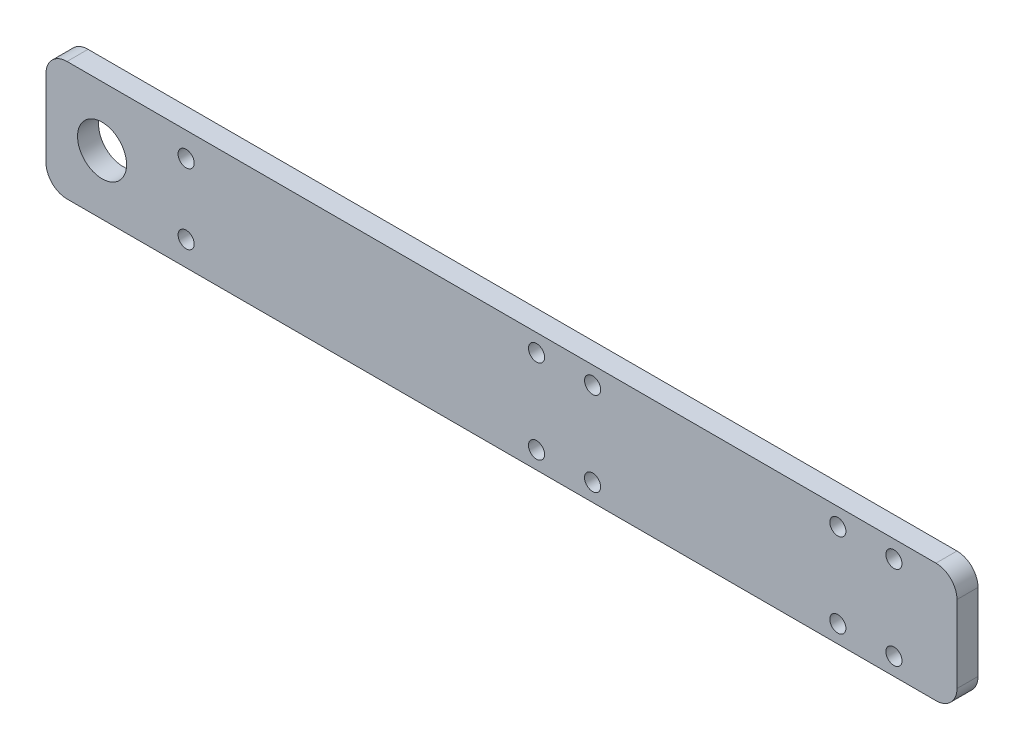
ISO-10303-21;
HEADER;
FILE_DESCRIPTION(('STEP AP214'),'2;1');
FILE_NAME('part.step','',(''),(''),'','','');
FILE_SCHEMA(('AUTOMOTIVE_DESIGN { 1 0 10303 214 1 1 1 1 }'));
ENDSEC;
DATA;
#1=APPLICATION_CONTEXT('core data for automotive mechanical design processes');
#2=APPLICATION_PROTOCOL_DEFINITION('international standard','automotive_design',2000,#1);
#3=PRODUCT_CONTEXT('',#1,'mechanical');
#4=PRODUCT('Part','Part','',(#3));
#5=PRODUCT_RELATED_PRODUCT_CATEGORY('part','',(#4));
#6=PRODUCT_DEFINITION_FORMATION('','',#4);
#7=PRODUCT_DEFINITION_CONTEXT('part definition',#1,'design');
#8=PRODUCT_DEFINITION('design','',#6,#7);
#9=PRODUCT_DEFINITION_SHAPE('','',#8);
#10=(LENGTH_UNIT() NAMED_UNIT(*) SI_UNIT(.MILLI.,.METRE.));
#11=(NAMED_UNIT(*) PLANE_ANGLE_UNIT() SI_UNIT($,.RADIAN.));
#12=(NAMED_UNIT(*) SI_UNIT($,.STERADIAN.) SOLID_ANGLE_UNIT());
#13=UNCERTAINTY_MEASURE_WITH_UNIT(LENGTH_MEASURE(1.E-05),#10,'distance_accuracy_value','');
#14=(GEOMETRIC_REPRESENTATION_CONTEXT(3) GLOBAL_UNCERTAINTY_ASSIGNED_CONTEXT((#13)) GLOBAL_UNIT_ASSIGNED_CONTEXT((#10,
#11,#12)) REPRESENTATION_CONTEXT('',''));
#15=CARTESIAN_POINT('',(0.,0.,0.));
#16=DIRECTION('',(0.,0.,1.));
#17=DIRECTION('',(1.,0.,0.));
#18=AXIS2_PLACEMENT_3D('',#15,#16,#17);
#19=CARTESIAN_POINT('',(0.,0.,3.));
#20=DIRECTION('',(0.,0.,-1.));
#21=DIRECTION('',(-1.,0.,0.));
#22=AXIS2_PLACEMENT_3D('',#19,#20,#21);
#23=PLANE('',#22);
#24=DIRECTION('',(1.,0.,0.));
#25=VECTOR('',#24,1.);
#26=CARTESIAN_POINT('',(-65.,-8.5,3.));
#27=LINE('',#26,#25);
#28=CARTESIAN_POINT('',(-62.,-8.5,3.));
#29=VERTEX_POINT('',#28);
#30=CARTESIAN_POINT('',(62.,-8.5,3.));
#31=VERTEX_POINT('',#30);
#32=EDGE_CURVE('E136',#29,#31,#27,.T.);
#33=ORIENTED_EDGE('',*,*,#32,.T.);
#34=CARTESIAN_POINT('',(62.,-5.5,3.));
#35=DIRECTION('',(0.,0.,-1.));
#36=DIRECTION('',(-1.,0.,0.));
#37=AXIS2_PLACEMENT_3D('',#34,#35,#36);
#38=CIRCLE('',#37,3.);
#39=CARTESIAN_POINT('',(65.,-5.5,3.));
#40=VERTEX_POINT('',#39);
#41=EDGE_CURVE('E155',#31,#40,#38,.F.);
#42=ORIENTED_EDGE('',*,*,#41,.T.);
#43=DIRECTION('',(0.,1.,0.));
#44=VECTOR('',#43,1.);
#45=CARTESIAN_POINT('',(65.,-8.5,3.));
#46=LINE('',#45,#44);
#47=CARTESIAN_POINT('',(65.,5.5,3.));
#48=VERTEX_POINT('',#47);
#49=EDGE_CURVE('E119',#40,#48,#46,.T.);
#50=ORIENTED_EDGE('',*,*,#49,.T.);
#51=CARTESIAN_POINT('',(62.,5.5,3.));
#52=DIRECTION('',(0.,0.,-1.));
#53=DIRECTION('',(-1.,0.,0.));
#54=AXIS2_PLACEMENT_3D('',#51,#52,#53);
#55=CIRCLE('',#54,3.);
#56=CARTESIAN_POINT('',(62.,8.5,3.));
#57=VERTEX_POINT('',#56);
#58=EDGE_CURVE('E153',#48,#57,#55,.F.);
#59=ORIENTED_EDGE('',*,*,#58,.T.);
#60=DIRECTION('',(-1.,0.,0.));
#61=VECTOR('',#60,1.);
#62=CARTESIAN_POINT('',(-65.,8.5,3.));
#63=LINE('',#62,#61);
#64=CARTESIAN_POINT('',(-62.,8.5,3.));
#65=VERTEX_POINT('',#64);
#66=EDGE_CURVE('E175',#57,#65,#63,.T.);
#67=ORIENTED_EDGE('',*,*,#66,.T.);
#68=CARTESIAN_POINT('',(-62.,5.5,3.));
#69=DIRECTION('',(0.,0.,-1.));
#70=DIRECTION('',(-1.,0.,0.));
#71=AXIS2_PLACEMENT_3D('',#68,#69,#70);
#72=CIRCLE('',#71,3.);
#73=CARTESIAN_POINT('',(-65.,5.5,3.));
#74=VERTEX_POINT('',#73);
#75=EDGE_CURVE('E54',#65,#74,#72,.F.);
#76=ORIENTED_EDGE('',*,*,#75,.T.);
#77=DIRECTION('',(0.,-1.,0.));
#78=VECTOR('',#77,1.);
#79=CARTESIAN_POINT('',(-65.,-8.5,3.));
#80=LINE('',#79,#78);
#81=CARTESIAN_POINT('',(-65.,-5.5,3.));
#82=VERTEX_POINT('',#81);
#83=EDGE_CURVE('E165',#74,#82,#80,.T.);
#84=ORIENTED_EDGE('',*,*,#83,.T.);
#85=CARTESIAN_POINT('',(-62.,-5.5,3.));
#86=DIRECTION('',(0.,0.,-1.));
#87=DIRECTION('',(-1.,0.,0.));
#88=AXIS2_PLACEMENT_3D('',#85,#86,#87);
#89=CIRCLE('',#88,3.);
#90=EDGE_CURVE('E151',#82,#29,#89,.F.);
#91=ORIENTED_EDGE('',*,*,#90,.T.);
#92=EDGE_LOOP('',(#33,#42,#50,#59,#67,#76,#84,#91));
#93=FACE_BOUND('',#92,.T.);
#94=CARTESIAN_POINT('',(-57.,0.,3.));
#95=DIRECTION('',(0.,0.,1.));
#96=DIRECTION('',(1.,0.,0.));
#97=AXIS2_PLACEMENT_3D('',#94,#95,#96);
#98=CIRCLE('',#97,3.5);
#99=CARTESIAN_POINT('',(-53.5,0.,3.));
#100=VERTEX_POINT('',#99);
#101=EDGE_CURVE('E127',#100,#100,#98,.T.);
#102=ORIENTED_EDGE('',*,*,#101,.F.);
#103=EDGE_LOOP('',(#102));
#104=FACE_BOUND('',#103,.T.);
#105=CARTESIAN_POINT('',(-45.,4.99999999999998,3.));
#106=DIRECTION('',(0.,0.,1.));
#107=DIRECTION('',(1.,0.,0.));
#108=AXIS2_PLACEMENT_3D('',#105,#106,#107);
#109=CIRCLE('',#108,1.15);
#110=CARTESIAN_POINT('',(-43.85,4.99999999999998,3.));
#111=VERTEX_POINT('',#110);
#112=EDGE_CURVE('E180',#111,#111,#109,.T.);
#113=ORIENTED_EDGE('',*,*,#112,.F.);
#114=EDGE_LOOP('',(#113));
#115=FACE_BOUND('',#114,.T.);
#116=CARTESIAN_POINT('',(-45.,-5.00000000000002,3.));
#117=DIRECTION('',(0.,0.,1.));
#118=DIRECTION('',(-1.,0.,0.));
#119=AXIS2_PLACEMENT_3D('',#116,#117,#118);
#120=CIRCLE('',#119,1.15);
#121=CARTESIAN_POINT('',(-46.15,-5.00000000000002,3.));
#122=VERTEX_POINT('',#121);
#123=EDGE_CURVE('E185',#122,#122,#120,.T.);
#124=ORIENTED_EDGE('',*,*,#123,.F.);
#125=EDGE_LOOP('',(#124));
#126=FACE_BOUND('',#125,.T.);
#127=CARTESIAN_POINT('',(5.00000000000002,5.99999999999999,3.));
#128=DIRECTION('',(0.,0.,1.));
#129=DIRECTION('',(1.,0.,0.));
#130=AXIS2_PLACEMENT_3D('',#127,#128,#129);
#131=CIRCLE('',#130,1.15);
#132=CARTESIAN_POINT('',(6.15000000000002,5.99999999999999,3.));
#133=VERTEX_POINT('',#132);
#134=EDGE_CURVE('E191',#133,#133,#131,.T.);
#135=ORIENTED_EDGE('',*,*,#134,.F.);
#136=EDGE_LOOP('',(#135));
#137=FACE_BOUND('',#136,.T.);
#138=CARTESIAN_POINT('',(13.,5.99999999999999,3.));
#139=DIRECTION('',(0.,0.,1.));
#140=DIRECTION('',(1.,0.,0.));
#141=AXIS2_PLACEMENT_3D('',#138,#139,#140);
#142=CIRCLE('',#141,1.15000000000001);
#143=CARTESIAN_POINT('',(14.15,5.99999999999999,3.));
#144=VERTEX_POINT('',#143);
#145=EDGE_CURVE('E197',#144,#144,#142,.T.);
#146=ORIENTED_EDGE('',*,*,#145,.F.);
#147=EDGE_LOOP('',(#146));
#148=FACE_BOUND('',#147,.T.);
#149=CARTESIAN_POINT('',(5.00000000000002,-6.00000000000001,3.));
#150=DIRECTION('',(0.,0.,1.));
#151=DIRECTION('',(-1.,0.,0.));
#152=AXIS2_PLACEMENT_3D('',#149,#150,#151);
#153=CIRCLE('',#152,1.15);
#154=CARTESIAN_POINT('',(3.85000000000002,-6.00000000000001,3.));
#155=VERTEX_POINT('',#154);
#156=EDGE_CURVE('E203',#155,#155,#153,.T.);
#157=ORIENTED_EDGE('',*,*,#156,.F.);
#158=EDGE_LOOP('',(#157));
#159=FACE_BOUND('',#158,.T.);
#160=CARTESIAN_POINT('',(13.,-6.00000000000001,3.));
#161=DIRECTION('',(0.,0.,1.));
#162=DIRECTION('',(-1.,0.,0.));
#163=AXIS2_PLACEMENT_3D('',#160,#161,#162);
#164=CIRCLE('',#163,1.15);
#165=CARTESIAN_POINT('',(11.85,-6.00000000000001,3.));
#166=VERTEX_POINT('',#165);
#167=EDGE_CURVE('E209',#166,#166,#164,.T.);
#168=ORIENTED_EDGE('',*,*,#167,.F.);
#169=EDGE_LOOP('',(#168));
#170=FACE_BOUND('',#169,.T.);
#171=CARTESIAN_POINT('',(56.,5.99999999999999,3.));
#172=DIRECTION('',(0.,0.,1.));
#173=DIRECTION('',(1.,0.,0.));
#174=AXIS2_PLACEMENT_3D('',#171,#172,#173);
#175=CIRCLE('',#174,1.15);
#176=CARTESIAN_POINT('',(57.15,5.99999999999999,3.));
#177=VERTEX_POINT('',#176);
#178=EDGE_CURVE('E215',#177,#177,#175,.T.);
#179=ORIENTED_EDGE('',*,*,#178,.F.);
#180=EDGE_LOOP('',(#179));
#181=FACE_BOUND('',#180,.T.);
#182=CARTESIAN_POINT('',(48.,5.99999999999999,3.));
#183=DIRECTION('',(0.,0.,1.));
#184=DIRECTION('',(1.,0.,0.));
#185=AXIS2_PLACEMENT_3D('',#182,#183,#184);
#186=CIRCLE('',#185,1.15);
#187=CARTESIAN_POINT('',(49.15,5.99999999999999,3.));
#188=VERTEX_POINT('',#187);
#189=EDGE_CURVE('E221',#188,#188,#186,.T.);
#190=ORIENTED_EDGE('',*,*,#189,.F.);
#191=EDGE_LOOP('',(#190));
#192=FACE_BOUND('',#191,.T.);
#193=CARTESIAN_POINT('',(56.,-6.,3.));
#194=DIRECTION('',(0.,0.,1.));
#195=DIRECTION('',(-1.,0.,0.));
#196=AXIS2_PLACEMENT_3D('',#193,#194,#195);
#197=CIRCLE('',#196,1.15);
#198=CARTESIAN_POINT('',(54.85,-6.,3.));
#199=VERTEX_POINT('',#198);
#200=EDGE_CURVE('E227',#199,#199,#197,.T.);
#201=ORIENTED_EDGE('',*,*,#200,.F.);
#202=EDGE_LOOP('',(#201));
#203=FACE_BOUND('',#202,.T.);
#204=CARTESIAN_POINT('',(48.,-6.,3.));
#205=DIRECTION('',(0.,0.,1.));
#206=DIRECTION('',(-1.,0.,0.));
#207=AXIS2_PLACEMENT_3D('',#204,#205,#206);
#208=CIRCLE('',#207,1.15);
#209=CARTESIAN_POINT('',(46.85,-6.,3.));
#210=VERTEX_POINT('',#209);
#211=EDGE_CURVE('E233',#210,#210,#208,.T.);
#212=ORIENTED_EDGE('',*,*,#211,.F.);
#213=EDGE_LOOP('',(#212));
#214=FACE_BOUND('',#213,.T.);
#215=ADVANCED_FACE('F34',(#93,#104,#115,#126,#137,#148,#159,#170,#181,#192,#203,#214),#23,.F.);
#216=CARTESIAN_POINT('',(0.,0.,0.));
#217=DIRECTION('',(0.,0.,-1.));
#218=DIRECTION('',(-1.,0.,0.));
#219=AXIS2_PLACEMENT_3D('',#216,#217,#218);
#220=PLANE('',#219);
#221=CARTESIAN_POINT('',(56.,-6.,0.));
#222=DIRECTION('',(0.,0.,1.));
#223=DIRECTION('',(-1.,0.,0.));
#224=AXIS2_PLACEMENT_3D('',#221,#222,#223);
#225=CIRCLE('',#224,1.15);
#226=CARTESIAN_POINT('',(54.85,-6.,0.));
#227=VERTEX_POINT('',#226);
#228=EDGE_CURVE('E230',#227,#227,#225,.T.);
#229=ORIENTED_EDGE('',*,*,#228,.T.);
#230=EDGE_LOOP('',(#229));
#231=FACE_BOUND('',#230,.T.);
#232=CARTESIAN_POINT('',(56.,5.99999999999999,0.));
#233=DIRECTION('',(0.,0.,1.));
#234=DIRECTION('',(1.,0.,0.));
#235=AXIS2_PLACEMENT_3D('',#232,#233,#234);
#236=CIRCLE('',#235,1.15);
#237=CARTESIAN_POINT('',(57.15,5.99999999999999,0.));
#238=VERTEX_POINT('',#237);
#239=EDGE_CURVE('E218',#238,#238,#236,.T.);
#240=ORIENTED_EDGE('',*,*,#239,.T.);
#241=EDGE_LOOP('',(#240));
#242=FACE_BOUND('',#241,.T.);
#243=CARTESIAN_POINT('',(5.00000000000002,-6.00000000000001,0.));
#244=DIRECTION('',(0.,0.,1.));
#245=DIRECTION('',(-1.,0.,0.));
#246=AXIS2_PLACEMENT_3D('',#243,#244,#245);
#247=CIRCLE('',#246,1.15);
#248=CARTESIAN_POINT('',(3.85000000000002,-6.00000000000001,0.));
#249=VERTEX_POINT('',#248);
#250=EDGE_CURVE('E206',#249,#249,#247,.T.);
#251=ORIENTED_EDGE('',*,*,#250,.T.);
#252=EDGE_LOOP('',(#251));
#253=FACE_BOUND('',#252,.T.);
#254=CARTESIAN_POINT('',(5.00000000000002,5.99999999999999,0.));
#255=DIRECTION('',(0.,0.,1.));
#256=DIRECTION('',(1.,0.,0.));
#257=AXIS2_PLACEMENT_3D('',#254,#255,#256);
#258=CIRCLE('',#257,1.15);
#259=CARTESIAN_POINT('',(6.15000000000002,5.99999999999999,0.));
#260=VERTEX_POINT('',#259);
#261=EDGE_CURVE('E194',#260,#260,#258,.T.);
#262=ORIENTED_EDGE('',*,*,#261,.T.);
#263=EDGE_LOOP('',(#262));
#264=FACE_BOUND('',#263,.T.);
#265=CARTESIAN_POINT('',(-45.,4.99999999999998,0.));
#266=DIRECTION('',(0.,0.,1.));
#267=DIRECTION('',(1.,0.,0.));
#268=AXIS2_PLACEMENT_3D('',#265,#266,#267);
#269=CIRCLE('',#268,1.15);
#270=CARTESIAN_POINT('',(-43.85,4.99999999999998,0.));
#271=VERTEX_POINT('',#270);
#272=EDGE_CURVE('E182',#271,#271,#269,.T.);
#273=ORIENTED_EDGE('',*,*,#272,.T.);
#274=EDGE_LOOP('',(#273));
#275=FACE_BOUND('',#274,.T.);
#276=DIRECTION('',(0.,1.,0.));
#277=VECTOR('',#276,1.);
#278=CARTESIAN_POINT('',(65.,-8.5,0.));
#279=LINE('',#278,#277);
#280=CARTESIAN_POINT('',(65.,-5.5,0.));
#281=VERTEX_POINT('',#280);
#282=CARTESIAN_POINT('',(65.,5.5,0.));
#283=VERTEX_POINT('',#282);
#284=EDGE_CURVE('E116',#281,#283,#279,.T.);
#285=ORIENTED_EDGE('',*,*,#284,.F.);
#286=CARTESIAN_POINT('',(62.,-5.5,0.));
#287=DIRECTION('',(0.,0.,-1.));
#288=DIRECTION('',(-1.,0.,0.));
#289=AXIS2_PLACEMENT_3D('',#286,#287,#288);
#290=CIRCLE('',#289,3.);
#291=CARTESIAN_POINT('',(62.,-8.5,0.));
#292=VERTEX_POINT('',#291);
#293=EDGE_CURVE('E99',#281,#292,#290,.T.);
#294=ORIENTED_EDGE('',*,*,#293,.T.);
#295=DIRECTION('',(1.,0.,0.));
#296=VECTOR('',#295,1.);
#297=CARTESIAN_POINT('',(-65.,-8.5,0.));
#298=LINE('',#297,#296);
#299=CARTESIAN_POINT('',(-62.,-8.5,0.));
#300=VERTEX_POINT('',#299);
#301=EDGE_CURVE('E140',#300,#292,#298,.T.);
#302=ORIENTED_EDGE('',*,*,#301,.F.);
#303=CARTESIAN_POINT('',(-62.,-5.5,0.));
#304=DIRECTION('',(0.,0.,-1.));
#305=DIRECTION('',(-1.,0.,0.));
#306=AXIS2_PLACEMENT_3D('',#303,#304,#305);
#307=CIRCLE('',#306,3.);
#308=CARTESIAN_POINT('',(-65.,-5.5,0.));
#309=VERTEX_POINT('',#308);
#310=EDGE_CURVE('E144',#300,#309,#307,.T.);
#311=ORIENTED_EDGE('',*,*,#310,.T.);
#312=DIRECTION('',(0.,-1.,0.));
#313=VECTOR('',#312,1.);
#314=CARTESIAN_POINT('',(-65.,-8.5,0.));
#315=LINE('',#314,#313);
#316=CARTESIAN_POINT('',(-65.,5.5,0.));
#317=VERTEX_POINT('',#316);
#318=EDGE_CURVE('E130',#317,#309,#315,.T.);
#319=ORIENTED_EDGE('',*,*,#318,.F.);
#320=CARTESIAN_POINT('',(-62.,5.5,0.));
#321=DIRECTION('',(0.,0.,-1.));
#322=DIRECTION('',(-1.,0.,0.));
#323=AXIS2_PLACEMENT_3D('',#320,#321,#322);
#324=CIRCLE('',#323,3.);
#325=CARTESIAN_POINT('',(-62.,8.5,0.));
#326=VERTEX_POINT('',#325);
#327=EDGE_CURVE('E120',#317,#326,#324,.T.);
#328=ORIENTED_EDGE('',*,*,#327,.T.);
#329=DIRECTION('',(-1.,0.,0.));
#330=VECTOR('',#329,1.);
#331=CARTESIAN_POINT('',(-65.,8.5,0.));
#332=LINE('',#331,#330);
#333=CARTESIAN_POINT('',(62.,8.5,0.));
#334=VERTEX_POINT('',#333);
#335=EDGE_CURVE('E126',#334,#326,#332,.T.);
#336=ORIENTED_EDGE('',*,*,#335,.F.);
#337=CARTESIAN_POINT('',(62.,5.5,0.));
#338=DIRECTION('',(0.,0.,-1.));
#339=DIRECTION('',(-1.,0.,0.));
#340=AXIS2_PLACEMENT_3D('',#337,#338,#339);
#341=CIRCLE('',#340,3.);
#342=EDGE_CURVE('E110',#334,#283,#341,.T.);
#343=ORIENTED_EDGE('',*,*,#342,.T.);
#344=EDGE_LOOP('',(#285,#294,#302,#311,#319,#328,#336,#343));
#345=FACE_BOUND('',#344,.T.);
#346=CARTESIAN_POINT('',(-57.,0.,0.));
#347=DIRECTION('',(0.,0.,1.));
#348=DIRECTION('',(1.,0.,0.));
#349=AXIS2_PLACEMENT_3D('',#346,#347,#348);
#350=CIRCLE('',#349,3.5);
#351=CARTESIAN_POINT('',(-53.5,0.,0.));
#352=VERTEX_POINT('',#351);
#353=EDGE_CURVE('E133',#352,#352,#350,.T.);
#354=ORIENTED_EDGE('',*,*,#353,.T.);
#355=EDGE_LOOP('',(#354));
#356=FACE_BOUND('',#355,.T.);
#357=CARTESIAN_POINT('',(-45.,-5.00000000000002,0.));
#358=DIRECTION('',(0.,0.,1.));
#359=DIRECTION('',(-1.,0.,0.));
#360=AXIS2_PLACEMENT_3D('',#357,#358,#359);
#361=CIRCLE('',#360,1.15);
#362=CARTESIAN_POINT('',(-46.15,-5.00000000000002,0.));
#363=VERTEX_POINT('',#362);
#364=EDGE_CURVE('E188',#363,#363,#361,.T.);
#365=ORIENTED_EDGE('',*,*,#364,.T.);
#366=EDGE_LOOP('',(#365));
#367=FACE_BOUND('',#366,.T.);
#368=CARTESIAN_POINT('',(13.,5.99999999999999,0.));
#369=DIRECTION('',(0.,0.,1.));
#370=DIRECTION('',(1.,0.,0.));
#371=AXIS2_PLACEMENT_3D('',#368,#369,#370);
#372=CIRCLE('',#371,1.15000000000001);
#373=CARTESIAN_POINT('',(14.15,5.99999999999999,0.));
#374=VERTEX_POINT('',#373);
#375=EDGE_CURVE('E200',#374,#374,#372,.T.);
#376=ORIENTED_EDGE('',*,*,#375,.T.);
#377=EDGE_LOOP('',(#376));
#378=FACE_BOUND('',#377,.T.);
#379=CARTESIAN_POINT('',(13.,-6.00000000000001,0.));
#380=DIRECTION('',(0.,0.,1.));
#381=DIRECTION('',(-1.,0.,0.));
#382=AXIS2_PLACEMENT_3D('',#379,#380,#381);
#383=CIRCLE('',#382,1.15);
#384=CARTESIAN_POINT('',(11.85,-6.00000000000001,0.));
#385=VERTEX_POINT('',#384);
#386=EDGE_CURVE('E212',#385,#385,#383,.T.);
#387=ORIENTED_EDGE('',*,*,#386,.T.);
#388=EDGE_LOOP('',(#387));
#389=FACE_BOUND('',#388,.T.);
#390=CARTESIAN_POINT('',(48.,5.99999999999999,0.));
#391=DIRECTION('',(0.,0.,1.));
#392=DIRECTION('',(1.,0.,0.));
#393=AXIS2_PLACEMENT_3D('',#390,#391,#392);
#394=CIRCLE('',#393,1.15);
#395=CARTESIAN_POINT('',(49.15,5.99999999999999,0.));
#396=VERTEX_POINT('',#395);
#397=EDGE_CURVE('E224',#396,#396,#394,.T.);
#398=ORIENTED_EDGE('',*,*,#397,.T.);
#399=EDGE_LOOP('',(#398));
#400=FACE_BOUND('',#399,.T.);
#401=CARTESIAN_POINT('',(48.,-6.,0.));
#402=DIRECTION('',(0.,0.,1.));
#403=DIRECTION('',(-1.,0.,0.));
#404=AXIS2_PLACEMENT_3D('',#401,#402,#403);
#405=CIRCLE('',#404,1.15);
#406=CARTESIAN_POINT('',(46.85,-6.,0.));
#407=VERTEX_POINT('',#406);
#408=EDGE_CURVE('E236',#407,#407,#405,.T.);
#409=ORIENTED_EDGE('',*,*,#408,.T.);
#410=EDGE_LOOP('',(#409));
#411=FACE_BOUND('',#410,.T.);
#412=ADVANCED_FACE('F123',(#231,#242,#253,#264,#275,#345,#356,#367,#378,#389,#400,#411),#220,.T.);
#413=CARTESIAN_POINT('',(65.,-8.5,3.));
#414=DIRECTION('',(-1.,0.,0.));
#415=DIRECTION('',(0.,0.,1.));
#416=AXIS2_PLACEMENT_3D('',#413,#414,#415);
#417=PLANE('',#416);
#418=ORIENTED_EDGE('',*,*,#49,.F.);
#419=DIRECTION('',(0.,0.,-1.));
#420=VECTOR('',#419,1.);
#421=CARTESIAN_POINT('',(65.,-5.5,3.));
#422=LINE('',#421,#420);
#423=EDGE_CURVE('E103',#40,#281,#422,.T.);
#424=ORIENTED_EDGE('',*,*,#423,.T.);
#425=ORIENTED_EDGE('',*,*,#284,.T.);
#426=DIRECTION('',(0.,0.,-1.));
#427=VECTOR('',#426,1.);
#428=CARTESIAN_POINT('',(65.,5.5,3.));
#429=LINE('',#428,#427);
#430=EDGE_CURVE('E121',#283,#48,#429,.F.);
#431=ORIENTED_EDGE('',*,*,#430,.T.);
#432=EDGE_LOOP('',(#418,#424,#425,#431));
#433=FACE_BOUND('',#432,.T.);
#434=ADVANCED_FACE('F115',(#433),#417,.F.);
#435=CARTESIAN_POINT('',(-65.,8.5,3.));
#436=DIRECTION('',(0.,-1.,0.));
#437=DIRECTION('',(0.,0.,-1.));
#438=AXIS2_PLACEMENT_3D('',#435,#436,#437);
#439=PLANE('',#438);
#440=ORIENTED_EDGE('',*,*,#66,.F.);
#441=DIRECTION('',(0.,0.,-1.));
#442=VECTOR('',#441,1.);
#443=CARTESIAN_POINT('',(62.,8.5,3.));
#444=LINE('',#443,#442);
#445=EDGE_CURVE('E159',#57,#334,#444,.T.);
#446=ORIENTED_EDGE('',*,*,#445,.T.);
#447=ORIENTED_EDGE('',*,*,#335,.T.);
#448=DIRECTION('',(0.,0.,-1.));
#449=VECTOR('',#448,1.);
#450=CARTESIAN_POINT('',(-62.,8.5,3.));
#451=LINE('',#450,#449);
#452=EDGE_CURVE('E157',#326,#65,#451,.F.);
#453=ORIENTED_EDGE('',*,*,#452,.T.);
#454=EDGE_LOOP('',(#440,#446,#447,#453));
#455=FACE_BOUND('',#454,.T.);
#456=ADVANCED_FACE('F261',(#455),#439,.F.);
#457=CARTESIAN_POINT('',(-65.,-8.5,3.));
#458=DIRECTION('',(1.,0.,0.));
#459=DIRECTION('',(0.,0.,-1.));
#460=AXIS2_PLACEMENT_3D('',#457,#458,#459);
#461=PLANE('',#460);
#462=ORIENTED_EDGE('',*,*,#318,.T.);
#463=DIRECTION('',(0.,0.,-1.));
#464=VECTOR('',#463,1.);
#465=CARTESIAN_POINT('',(-65.,-5.5,3.));
#466=LINE('',#465,#464);
#467=EDGE_CURVE('E11',#309,#82,#466,.F.);
#468=ORIENTED_EDGE('',*,*,#467,.T.);
#469=ORIENTED_EDGE('',*,*,#83,.F.);
#470=DIRECTION('',(0.,0.,-1.));
#471=VECTOR('',#470,1.);
#472=CARTESIAN_POINT('',(-65.,5.5,3.));
#473=LINE('',#472,#471);
#474=EDGE_CURVE('E42',#74,#317,#473,.T.);
#475=ORIENTED_EDGE('',*,*,#474,.T.);
#476=EDGE_LOOP('',(#462,#468,#469,#475));
#477=FACE_BOUND('',#476,.T.);
#478=ADVANCED_FACE('F164',(#477),#461,.F.);
#479=CARTESIAN_POINT('',(-65.,-8.5,3.));
#480=DIRECTION('',(0.,1.,0.));
#481=DIRECTION('',(0.,0.,1.));
#482=AXIS2_PLACEMENT_3D('',#479,#480,#481);
#483=PLANE('',#482);
#484=ORIENTED_EDGE('',*,*,#301,.T.);
#485=DIRECTION('',(0.,0.,-1.));
#486=VECTOR('',#485,1.);
#487=CARTESIAN_POINT('',(62.,-8.5,3.));
#488=LINE('',#487,#486);
#489=EDGE_CURVE('E104',#292,#31,#488,.F.);
#490=ORIENTED_EDGE('',*,*,#489,.T.);
#491=ORIENTED_EDGE('',*,*,#32,.F.);
#492=DIRECTION('',(0.,0.,-1.));
#493=VECTOR('',#492,1.);
#494=CARTESIAN_POINT('',(-62.,-8.5,3.));
#495=LINE('',#494,#493);
#496=EDGE_CURVE('E109',#29,#300,#495,.T.);
#497=ORIENTED_EDGE('',*,*,#496,.T.);
#498=EDGE_LOOP('',(#484,#490,#491,#497));
#499=FACE_BOUND('',#498,.T.);
#500=ADVANCED_FACE('F173',(#499),#483,.F.);
#501=CARTESIAN_POINT('',(-57.,0.,3.));
#502=DIRECTION('',(0.,0.,-1.));
#503=DIRECTION('',(-1.,0.,0.));
#504=AXIS2_PLACEMENT_3D('',#501,#502,#503);
#505=CYLINDRICAL_SURFACE('',#504,3.5);
#506=ORIENTED_EDGE('',*,*,#101,.T.);
#507=EDGE_LOOP('',(#506));
#508=FACE_BOUND('',#507,.T.);
#509=ORIENTED_EDGE('',*,*,#353,.F.);
#510=EDGE_LOOP('',(#509));
#511=FACE_BOUND('',#510,.T.);
#512=ADVANCED_FACE('F254',(#508,#511),#505,.F.);
#513=CARTESIAN_POINT('',(-45.,4.99999999999998,3.));
#514=DIRECTION('',(0.,0.,-1.));
#515=DIRECTION('',(-1.,0.,0.));
#516=AXIS2_PLACEMENT_3D('',#513,#514,#515);
#517=CYLINDRICAL_SURFACE('',#516,1.15);
#518=ORIENTED_EDGE('',*,*,#112,.T.);
#519=EDGE_LOOP('',(#518));
#520=FACE_BOUND('',#519,.T.);
#521=ORIENTED_EDGE('',*,*,#272,.F.);
#522=EDGE_LOOP('',(#521));
#523=FACE_BOUND('',#522,.T.);
#524=ADVANCED_FACE('F422',(#520,#523),#517,.F.);
#525=CARTESIAN_POINT('',(-45.,-5.00000000000002,3.));
#526=DIRECTION('',(0.,0.,-1.));
#527=DIRECTION('',(-1.,0.,0.));
#528=AXIS2_PLACEMENT_3D('',#525,#526,#527);
#529=CYLINDRICAL_SURFACE('',#528,1.15);
#530=ORIENTED_EDGE('',*,*,#123,.T.);
#531=EDGE_LOOP('',(#530));
#532=FACE_BOUND('',#531,.T.);
#533=ORIENTED_EDGE('',*,*,#364,.F.);
#534=EDGE_LOOP('',(#533));
#535=FACE_BOUND('',#534,.T.);
#536=ADVANCED_FACE('F412',(#532,#535),#529,.F.);
#537=CARTESIAN_POINT('',(5.00000000000002,5.99999999999999,3.));
#538=DIRECTION('',(0.,0.,-1.));
#539=DIRECTION('',(-1.,0.,0.));
#540=AXIS2_PLACEMENT_3D('',#537,#538,#539);
#541=CYLINDRICAL_SURFACE('',#540,1.15);
#542=ORIENTED_EDGE('',*,*,#134,.T.);
#543=EDGE_LOOP('',(#542));
#544=FACE_BOUND('',#543,.T.);
#545=ORIENTED_EDGE('',*,*,#261,.F.);
#546=EDGE_LOOP('',(#545));
#547=FACE_BOUND('',#546,.T.);
#548=ADVANCED_FACE('F402',(#544,#547),#541,.F.);
#549=CARTESIAN_POINT('',(13.,5.99999999999999,3.));
#550=DIRECTION('',(0.,0.,-1.));
#551=DIRECTION('',(-1.,0.,0.));
#552=AXIS2_PLACEMENT_3D('',#549,#550,#551);
#553=CYLINDRICAL_SURFACE('',#552,1.15000000000001);
#554=ORIENTED_EDGE('',*,*,#145,.T.);
#555=EDGE_LOOP('',(#554));
#556=FACE_BOUND('',#555,.T.);
#557=ORIENTED_EDGE('',*,*,#375,.F.);
#558=EDGE_LOOP('',(#557));
#559=FACE_BOUND('',#558,.T.);
#560=ADVANCED_FACE('F392',(#556,#559),#553,.F.);
#561=CARTESIAN_POINT('',(5.00000000000002,-6.00000000000001,3.));
#562=DIRECTION('',(0.,0.,-1.));
#563=DIRECTION('',(-1.,0.,0.));
#564=AXIS2_PLACEMENT_3D('',#561,#562,#563);
#565=CYLINDRICAL_SURFACE('',#564,1.15);
#566=ORIENTED_EDGE('',*,*,#156,.T.);
#567=EDGE_LOOP('',(#566));
#568=FACE_BOUND('',#567,.T.);
#569=ORIENTED_EDGE('',*,*,#250,.F.);
#570=EDGE_LOOP('',(#569));
#571=FACE_BOUND('',#570,.T.);
#572=ADVANCED_FACE('F382',(#568,#571),#565,.F.);
#573=CARTESIAN_POINT('',(13.,-6.00000000000001,3.));
#574=DIRECTION('',(0.,0.,-1.));
#575=DIRECTION('',(-1.,0.,0.));
#576=AXIS2_PLACEMENT_3D('',#573,#574,#575);
#577=CYLINDRICAL_SURFACE('',#576,1.15);
#578=ORIENTED_EDGE('',*,*,#167,.T.);
#579=EDGE_LOOP('',(#578));
#580=FACE_BOUND('',#579,.T.);
#581=ORIENTED_EDGE('',*,*,#386,.F.);
#582=EDGE_LOOP('',(#581));
#583=FACE_BOUND('',#582,.T.);
#584=ADVANCED_FACE('F372',(#580,#583),#577,.F.);
#585=CARTESIAN_POINT('',(56.,5.99999999999999,3.));
#586=DIRECTION('',(0.,0.,-1.));
#587=DIRECTION('',(-1.,0.,0.));
#588=AXIS2_PLACEMENT_3D('',#585,#586,#587);
#589=CYLINDRICAL_SURFACE('',#588,1.15);
#590=ORIENTED_EDGE('',*,*,#178,.T.);
#591=EDGE_LOOP('',(#590));
#592=FACE_BOUND('',#591,.T.);
#593=ORIENTED_EDGE('',*,*,#239,.F.);
#594=EDGE_LOOP('',(#593));
#595=FACE_BOUND('',#594,.T.);
#596=ADVANCED_FACE('F362',(#592,#595),#589,.F.);
#597=CARTESIAN_POINT('',(48.,5.99999999999999,3.));
#598=DIRECTION('',(0.,0.,-1.));
#599=DIRECTION('',(-1.,0.,0.));
#600=AXIS2_PLACEMENT_3D('',#597,#598,#599);
#601=CYLINDRICAL_SURFACE('',#600,1.15);
#602=ORIENTED_EDGE('',*,*,#189,.T.);
#603=EDGE_LOOP('',(#602));
#604=FACE_BOUND('',#603,.T.);
#605=ORIENTED_EDGE('',*,*,#397,.F.);
#606=EDGE_LOOP('',(#605));
#607=FACE_BOUND('',#606,.T.);
#608=ADVANCED_FACE('F352',(#604,#607),#601,.F.);
#609=CARTESIAN_POINT('',(56.,-6.,3.));
#610=DIRECTION('',(0.,0.,-1.));
#611=DIRECTION('',(-1.,0.,0.));
#612=AXIS2_PLACEMENT_3D('',#609,#610,#611);
#613=CYLINDRICAL_SURFACE('',#612,1.15);
#614=ORIENTED_EDGE('',*,*,#200,.T.);
#615=EDGE_LOOP('',(#614));
#616=FACE_BOUND('',#615,.T.);
#617=ORIENTED_EDGE('',*,*,#228,.F.);
#618=EDGE_LOOP('',(#617));
#619=FACE_BOUND('',#618,.T.);
#620=ADVANCED_FACE('F343',(#616,#619),#613,.F.);
#621=CARTESIAN_POINT('',(48.,-6.,3.));
#622=DIRECTION('',(0.,0.,-1.));
#623=DIRECTION('',(-1.,0.,0.));
#624=AXIS2_PLACEMENT_3D('',#621,#622,#623);
#625=CYLINDRICAL_SURFACE('',#624,1.15);
#626=ORIENTED_EDGE('',*,*,#211,.T.);
#627=EDGE_LOOP('',(#626));
#628=FACE_BOUND('',#627,.T.);
#629=ORIENTED_EDGE('',*,*,#408,.F.);
#630=EDGE_LOOP('',(#629));
#631=FACE_BOUND('',#630,.T.);
#632=ADVANCED_FACE('F242',(#628,#631),#625,.F.);
#633=CARTESIAN_POINT('',(62.,-5.5,3.));
#634=DIRECTION('',(0.,0.,-1.));
#635=DIRECTION('',(-1.,0.,0.));
#636=AXIS2_PLACEMENT_3D('',#633,#634,#635);
#637=CYLINDRICAL_SURFACE('',#636,3.);
#638=ORIENTED_EDGE('',*,*,#41,.F.);
#639=ORIENTED_EDGE('',*,*,#489,.F.);
#640=ORIENTED_EDGE('',*,*,#293,.F.);
#641=ORIENTED_EDGE('',*,*,#423,.F.);
#642=EDGE_LOOP('',(#638,#639,#640,#641));
#643=FACE_BOUND('',#642,.T.);
#644=ADVANCED_FACE('F102',(#643),#637,.T.);
#645=CARTESIAN_POINT('',(62.,5.5,3.));
#646=DIRECTION('',(0.,0.,-1.));
#647=DIRECTION('',(-1.,0.,0.));
#648=AXIS2_PLACEMENT_3D('',#645,#646,#647);
#649=CYLINDRICAL_SURFACE('',#648,3.);
#650=ORIENTED_EDGE('',*,*,#58,.F.);
#651=ORIENTED_EDGE('',*,*,#430,.F.);
#652=ORIENTED_EDGE('',*,*,#342,.F.);
#653=ORIENTED_EDGE('',*,*,#445,.F.);
#654=EDGE_LOOP('',(#650,#651,#652,#653));
#655=FACE_BOUND('',#654,.T.);
#656=ADVANCED_FACE('F269',(#655),#649,.T.);
#657=CARTESIAN_POINT('',(-62.,-5.5,3.));
#658=DIRECTION('',(0.,0.,-1.));
#659=DIRECTION('',(-1.,0.,0.));
#660=AXIS2_PLACEMENT_3D('',#657,#658,#659);
#661=CYLINDRICAL_SURFACE('',#660,3.);
#662=ORIENTED_EDGE('',*,*,#90,.F.);
#663=ORIENTED_EDGE('',*,*,#467,.F.);
#664=ORIENTED_EDGE('',*,*,#310,.F.);
#665=ORIENTED_EDGE('',*,*,#496,.F.);
#666=EDGE_LOOP('',(#662,#663,#664,#665));
#667=FACE_BOUND('',#666,.T.);
#668=ADVANCED_FACE('F170',(#667),#661,.T.);
#669=CARTESIAN_POINT('',(-62.,5.5,3.));
#670=DIRECTION('',(0.,0.,-1.));
#671=DIRECTION('',(-1.,0.,0.));
#672=AXIS2_PLACEMENT_3D('',#669,#670,#671);
#673=CYLINDRICAL_SURFACE('',#672,3.);
#674=ORIENTED_EDGE('',*,*,#75,.F.);
#675=ORIENTED_EDGE('',*,*,#452,.F.);
#676=ORIENTED_EDGE('',*,*,#327,.F.);
#677=ORIENTED_EDGE('',*,*,#474,.F.);
#678=EDGE_LOOP('',(#674,#675,#676,#677));
#679=FACE_BOUND('',#678,.T.);
#680=ADVANCED_FACE('F36',(#679),#673,.T.);
#681=CLOSED_SHELL('',(#215,#412,#434,#456,#478,#500,#512,#524,#536,#548,#560,#572,#584,#596,
#608,#620,#632,#644,#656,#668,#680));
#682=MANIFOLD_SOLID_BREP('B2',#681);
#683=ADVANCED_BREP_SHAPE_REPRESENTATION('',(#18,#682),#14);
#684=SHAPE_DEFINITION_REPRESENTATION(#9,#683);
ENDSEC;
END-ISO-10303-21;
